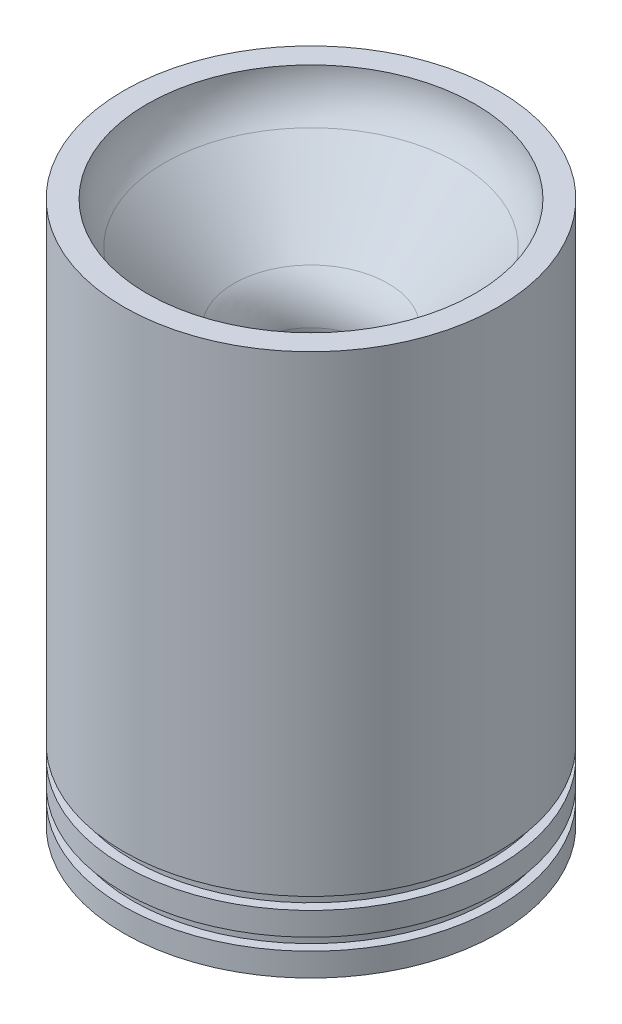
ISO-10303-21;
HEADER;
FILE_DESCRIPTION(('STEP AP214'),'2;1');
FILE_NAME('part.step','',(''),(''),'','','');
FILE_SCHEMA(('AUTOMOTIVE_DESIGN { 1 0 10303 214 1 1 1 1 }'));
ENDSEC;
DATA;
#1=APPLICATION_CONTEXT('core data for automotive mechanical design processes');
#2=APPLICATION_PROTOCOL_DEFINITION('international standard','automotive_design',2000,#1);
#3=PRODUCT_CONTEXT('',#1,'mechanical');
#4=PRODUCT('Part','Part','',(#3));
#5=PRODUCT_RELATED_PRODUCT_CATEGORY('part','',(#4));
#6=PRODUCT_DEFINITION_FORMATION('','',#4);
#7=PRODUCT_DEFINITION_CONTEXT('part definition',#1,'design');
#8=PRODUCT_DEFINITION('design','',#6,#7);
#9=PRODUCT_DEFINITION_SHAPE('','',#8);
#10=(LENGTH_UNIT() NAMED_UNIT(*) SI_UNIT(.MILLI.,.METRE.));
#11=(NAMED_UNIT(*) PLANE_ANGLE_UNIT() SI_UNIT($,.RADIAN.));
#12=(NAMED_UNIT(*) SI_UNIT($,.STERADIAN.) SOLID_ANGLE_UNIT());
#13=UNCERTAINTY_MEASURE_WITH_UNIT(LENGTH_MEASURE(1.E-05),#10,'distance_accuracy_value','');
#14=(GEOMETRIC_REPRESENTATION_CONTEXT(3) GLOBAL_UNCERTAINTY_ASSIGNED_CONTEXT((#13)) GLOBAL_UNIT_ASSIGNED_CONTEXT((#10,
#11,#12)) REPRESENTATION_CONTEXT('',''));
#15=CARTESIAN_POINT('',(0.,0.,0.));
#16=DIRECTION('',(0.,0.,1.));
#17=DIRECTION('',(1.,0.,0.));
#18=AXIS2_PLACEMENT_3D('',#15,#16,#17);
#19=CARTESIAN_POINT('',(-44.7802,0.,0.));
#20=DIRECTION('',(0.,1.,0.));
#21=DIRECTION('',(0.,0.,1.));
#22=AXIS2_PLACEMENT_3D('',#19,#20,#21);
#23=PLANE('',#22);
#24=CARTESIAN_POINT('',(0.,0.,0.));
#25=DIRECTION('',(0.,1.,0.));
#26=DIRECTION('',(0.,0.,1.));
#27=AXIS2_PLACEMENT_3D('',#24,#25,#26);
#28=CIRCLE('',#27,51.1302);
#29=CARTESIAN_POINT('',(0.,0.,51.1302));
#30=VERTEX_POINT('',#29);
#31=EDGE_CURVE('E133',#30,#30,#28,.T.);
#32=ORIENTED_EDGE('',*,*,#31,.T.);
#33=EDGE_LOOP('',(#32));
#34=FACE_BOUND('',#33,.T.);
#35=CARTESIAN_POINT('',(0.,0.,0.));
#36=DIRECTION('',(0.,1.,0.));
#37=DIRECTION('',(0.,0.,1.));
#38=AXIS2_PLACEMENT_3D('',#35,#36,#37);
#39=CIRCLE('',#38,44.7802);
#40=CARTESIAN_POINT('',(0.,0.,44.7802));
#41=VERTEX_POINT('',#40);
#42=EDGE_CURVE('E11',#41,#41,#39,.T.);
#43=ORIENTED_EDGE('',*,*,#42,.F.);
#44=EDGE_LOOP('',(#43));
#45=FACE_BOUND('',#44,.T.);
#46=ADVANCED_FACE('F42',(#34,#45),#23,.T.);
#47=CARTESIAN_POINT('',(0.,0.,0.));
#48=DIRECTION('',(0.,1.,0.));
#49=DIRECTION('',(0.,0.,1.));
#50=AXIS2_PLACEMENT_3D('',#47,#48,#49);
#51=TOROIDAL_SURFACE('',#50,28.5242,16.256);
#52=ORIENTED_EDGE('',*,*,#42,.T.);
#53=EDGE_LOOP('',(#52));
#54=FACE_BOUND('',#53,.T.);
#55=CARTESIAN_POINT('',(0.,-11.4947278349686,0.));
#56=DIRECTION('',(0.,1.,0.));
#57=DIRECTION('',(0.,0.,1.));
#58=AXIS2_PLACEMENT_3D('',#55,#56,#57);
#59=CIRCLE('',#58,40.0189278349684);
#60=CARTESIAN_POINT('',(0.,-11.4947278349686,40.0189278349684));
#61=VERTEX_POINT('',#60);
#62=EDGE_CURVE('E50',#61,#61,#59,.T.);
#63=ORIENTED_EDGE('',*,*,#62,.F.);
#64=EDGE_LOOP('',(#63));
#65=FACE_BOUND('',#64,.T.);
#66=ADVANCED_FACE('F153',(#54,#65),#51,.F.);
#67=CARTESIAN_POINT('',(0.,-30.4963835049053,0.));
#68=DIRECTION('',(0.,1.,0.));
#69=DIRECTION('',(0.,0.,1.));
#70=AXIS2_PLACEMENT_3D('',#67,#68,#69);
#71=CONICAL_SURFACE('',#70,21.0172721650315,0.785398163397454);
#72=ORIENTED_EDGE('',*,*,#62,.T.);
#73=EDGE_LOOP('',(#72));
#74=FACE_BOUND('',#73,.T.);
#75=CARTESIAN_POINT('',(0.,-30.4963835049053,0.));
#76=DIRECTION('',(0.,1.,0.));
#77=DIRECTION('',(0.,0.,1.));
#78=AXIS2_PLACEMENT_3D('',#75,#76,#77);
#79=CIRCLE('',#78,21.0172721650315);
#80=CARTESIAN_POINT('',(0.,-30.4963835049053,21.0172721650315));
#81=VERTEX_POINT('',#80);
#82=EDGE_CURVE('E55',#81,#81,#79,.T.);
#83=ORIENTED_EDGE('',*,*,#82,.F.);
#84=EDGE_LOOP('',(#83));
#85=FACE_BOUND('',#84,.T.);
#86=ADVANCED_FACE('F157',(#74,#85),#71,.F.);
#87=CARTESIAN_POINT('',(0.,-41.9911113398738,0.));
#88=DIRECTION('',(0.,1.,0.));
#89=DIRECTION('',(0.,0.,1.));
#90=AXIS2_PLACEMENT_3D('',#87,#88,#89);
#91=TOROIDAL_SURFACE('',#90,32.512,16.256);
#92=ORIENTED_EDGE('',*,*,#82,.T.);
#93=EDGE_LOOP('',(#92));
#94=FACE_BOUND('',#93,.T.);
#95=CARTESIAN_POINT('',(0.,-41.9911113398738,0.));
#96=DIRECTION('',(0.,1.,0.));
#97=DIRECTION('',(0.,0.,1.));
#98=AXIS2_PLACEMENT_3D('',#95,#96,#97);
#99=CIRCLE('',#98,16.256);
#100=CARTESIAN_POINT('',(0.,-41.9911113398738,16.256));
#101=VERTEX_POINT('',#100);
#102=EDGE_CURVE('E60',#101,#101,#99,.T.);
#103=ORIENTED_EDGE('',*,*,#102,.F.);
#104=EDGE_LOOP('',(#103));
#105=FACE_BOUND('',#104,.T.);
#106=ADVANCED_FACE('F161',(#94,#105),#91,.T.);
#107=CARTESIAN_POINT('',(0.,-41.9911113398738,0.));
#108=DIRECTION('',(0.,1.,0.));
#109=DIRECTION('',(0.,0.,1.));
#110=AXIS2_PLACEMENT_3D('',#107,#108,#109);
#111=TOROIDAL_SURFACE('',#110,22.7584,6.5024);
#112=ORIENTED_EDGE('',*,*,#102,.T.);
#113=EDGE_LOOP('',(#112));
#114=FACE_BOUND('',#113,.T.);
#115=CARTESIAN_POINT('',(0.,-43.6740562987485,0.));
#116=DIRECTION('',(0.,1.,0.));
#117=DIRECTION('',(0.,0.,1.));
#118=AXIS2_PLACEMENT_3D('',#115,#116,#117);
#119=CIRCLE('',#118,16.477563907138);
#120=CARTESIAN_POINT('',(0.,-43.6740562987485,16.477563907138));
#121=VERTEX_POINT('',#120);
#122=EDGE_CURVE('E76',#121,#121,#119,.T.);
#123=ORIENTED_EDGE('',*,*,#122,.F.);
#124=EDGE_LOOP('',(#123));
#125=FACE_BOUND('',#124,.T.);
#126=ADVANCED_FACE('F167',(#114,#125),#111,.T.);
#127=CARTESIAN_POINT('',(0.,-148.068609008784,0.));
#128=DIRECTION('',(0.,-1.,0.));
#129=DIRECTION('',(0.,0.,-1.));
#130=AXIS2_PLACEMENT_3D('',#127,#128,#129);
#131=CONICAL_SURFACE('',#130,44.45,0.261799387799146);
#132=ORIENTED_EDGE('',*,*,#122,.T.);
#133=EDGE_LOOP('',(#132));
#134=FACE_BOUND('',#133,.T.);
#135=CARTESIAN_POINT('',(0.,-148.068609008784,0.));
#136=DIRECTION('',(0.,1.,0.));
#137=DIRECTION('',(0.,0.,1.));
#138=AXIS2_PLACEMENT_3D('',#135,#136,#137);
#139=CIRCLE('',#138,44.45);
#140=CARTESIAN_POINT('',(0.,-148.068609008784,44.45));
#141=VERTEX_POINT('',#140);
#142=EDGE_CURVE('E81',#141,#141,#139,.T.);
#143=ORIENTED_EDGE('',*,*,#142,.F.);
#144=EDGE_LOOP('',(#143));
#145=FACE_BOUND('',#144,.T.);
#146=ADVANCED_FACE('F171',(#134,#145),#131,.F.);
#147=CARTESIAN_POINT('',(-51.1302,-148.068609008784,0.));
#148=DIRECTION('',(0.,-1.,0.));
#149=DIRECTION('',(0.,0.,-1.));
#150=AXIS2_PLACEMENT_3D('',#147,#148,#149);
#151=PLANE('',#150);
#152=ORIENTED_EDGE('',*,*,#142,.T.);
#153=EDGE_LOOP('',(#152));
#154=FACE_BOUND('',#153,.T.);
#155=CARTESIAN_POINT('',(0.,-148.068609008784,0.));
#156=DIRECTION('',(0.,1.,0.));
#157=DIRECTION('',(0.,0.,1.));
#158=AXIS2_PLACEMENT_3D('',#155,#156,#157);
#159=CIRCLE('',#158,51.1302);
#160=CARTESIAN_POINT('',(0.,-148.068609008784,51.1302));
#161=VERTEX_POINT('',#160);
#162=EDGE_CURVE('E86',#161,#161,#159,.T.);
#163=ORIENTED_EDGE('',*,*,#162,.F.);
#164=EDGE_LOOP('',(#163));
#165=FACE_BOUND('',#164,.T.);
#166=ADVANCED_FACE('F175',(#154,#165),#151,.T.);
#167=CARTESIAN_POINT('',(0.,0.,0.));
#168=DIRECTION('',(0.,1.,0.));
#169=DIRECTION('',(0.,0.,1.));
#170=AXIS2_PLACEMENT_3D('',#167,#168,#169);
#171=CYLINDRICAL_SURFACE('',#170,51.1302);
#172=ORIENTED_EDGE('',*,*,#162,.T.);
#173=EDGE_LOOP('',(#172));
#174=FACE_BOUND('',#173,.T.);
#175=CARTESIAN_POINT('',(0.,-141.718609008784,0.));
#176=DIRECTION('',(0.,1.,0.));
#177=DIRECTION('',(0.,0.,1.));
#178=AXIS2_PLACEMENT_3D('',#175,#176,#177);
#179=CIRCLE('',#178,51.1302);
#180=CARTESIAN_POINT('',(0.,-141.718609008784,51.1302));
#181=VERTEX_POINT('',#180);
#182=EDGE_CURVE('E94',#181,#181,#179,.T.);
#183=ORIENTED_EDGE('',*,*,#182,.F.);
#184=EDGE_LOOP('',(#183));
#185=FACE_BOUND('',#184,.T.);
#186=ADVANCED_FACE('F179',(#174,#185),#171,.T.);
#187=CARTESIAN_POINT('',(-51.1302,-141.718609008784,0.));
#188=DIRECTION('',(0.,1.,0.));
#189=DIRECTION('',(0.,0.,1.));
#190=AXIS2_PLACEMENT_3D('',#187,#188,#189);
#191=PLANE('',#190);
#192=ORIENTED_EDGE('',*,*,#182,.T.);
#193=EDGE_LOOP('',(#192));
#194=FACE_BOUND('',#193,.T.);
#195=CARTESIAN_POINT('',(0.,-141.718609008784,0.));
#196=DIRECTION('',(0.,1.,0.));
#197=DIRECTION('',(0.,0.,1.));
#198=AXIS2_PLACEMENT_3D('',#195,#196,#197);
#199=CIRCLE('',#198,48.5902);
#200=CARTESIAN_POINT('',(0.,-141.718609008784,48.5902));
#201=VERTEX_POINT('',#200);
#202=EDGE_CURVE('E98',#201,#201,#199,.T.);
#203=ORIENTED_EDGE('',*,*,#202,.F.);
#204=EDGE_LOOP('',(#203));
#205=FACE_BOUND('',#204,.T.);
#206=ADVANCED_FACE('F183',(#194,#205),#191,.T.);
#207=CARTESIAN_POINT('',(0.,0.,0.));
#208=DIRECTION('',(0.,1.,0.));
#209=DIRECTION('',(0.,0.,1.));
#210=AXIS2_PLACEMENT_3D('',#207,#208,#209);
#211=CYLINDRICAL_SURFACE('',#210,48.5902);
#212=ORIENTED_EDGE('',*,*,#202,.T.);
#213=EDGE_LOOP('',(#212));
#214=FACE_BOUND('',#213,.T.);
#215=CARTESIAN_POINT('',(0.,-138.416609008784,0.));
#216=DIRECTION('',(0.,1.,0.));
#217=DIRECTION('',(0.,0.,1.));
#218=AXIS2_PLACEMENT_3D('',#215,#216,#217);
#219=CIRCLE('',#218,48.5902);
#220=CARTESIAN_POINT('',(0.,-138.416609008784,48.5902));
#221=VERTEX_POINT('',#220);
#222=EDGE_CURVE('E103',#221,#221,#219,.T.);
#223=ORIENTED_EDGE('',*,*,#222,.F.);
#224=EDGE_LOOP('',(#223));
#225=FACE_BOUND('',#224,.T.);
#226=ADVANCED_FACE('F187',(#214,#225),#211,.T.);
#227=CARTESIAN_POINT('',(-48.5902,-138.416609008784,0.));
#228=DIRECTION('',(0.,-1.,0.));
#229=DIRECTION('',(0.,0.,-1.));
#230=AXIS2_PLACEMENT_3D('',#227,#228,#229);
#231=PLANE('',#230);
#232=ORIENTED_EDGE('',*,*,#222,.T.);
#233=EDGE_LOOP('',(#232));
#234=FACE_BOUND('',#233,.T.);
#235=CARTESIAN_POINT('',(0.,-138.416609008784,0.));
#236=DIRECTION('',(0.,1.,0.));
#237=DIRECTION('',(0.,0.,1.));
#238=AXIS2_PLACEMENT_3D('',#235,#236,#237);
#239=CIRCLE('',#238,51.1302);
#240=CARTESIAN_POINT('',(0.,-138.416609008784,51.1302));
#241=VERTEX_POINT('',#240);
#242=EDGE_CURVE('E108',#241,#241,#239,.T.);
#243=ORIENTED_EDGE('',*,*,#242,.F.);
#244=EDGE_LOOP('',(#243));
#245=FACE_BOUND('',#244,.T.);
#246=ADVANCED_FACE('F191',(#234,#245),#231,.T.);
#247=CARTESIAN_POINT('',(0.,0.,0.));
#248=DIRECTION('',(0.,1.,0.));
#249=DIRECTION('',(0.,0.,1.));
#250=AXIS2_PLACEMENT_3D('',#247,#248,#249);
#251=CYLINDRICAL_SURFACE('',#250,51.1302);
#252=ORIENTED_EDGE('',*,*,#242,.T.);
#253=EDGE_LOOP('',(#252));
#254=FACE_BOUND('',#253,.T.);
#255=CARTESIAN_POINT('',(0.,-132.066609008784,0.));
#256=DIRECTION('',(0.,1.,0.));
#257=DIRECTION('',(0.,0.,1.));
#258=AXIS2_PLACEMENT_3D('',#255,#256,#257);
#259=CIRCLE('',#258,51.1302);
#260=CARTESIAN_POINT('',(0.,-132.066609008784,51.1302));
#261=VERTEX_POINT('',#260);
#262=EDGE_CURVE('E115',#261,#261,#259,.T.);
#263=ORIENTED_EDGE('',*,*,#262,.F.);
#264=EDGE_LOOP('',(#263));
#265=FACE_BOUND('',#264,.T.);
#266=ADVANCED_FACE('F195',(#254,#265),#251,.T.);
#267=CARTESIAN_POINT('',(-51.1302,-132.066609008784,0.));
#268=DIRECTION('',(0.,1.,0.));
#269=DIRECTION('',(0.,0.,1.));
#270=AXIS2_PLACEMENT_3D('',#267,#268,#269);
#271=PLANE('',#270);
#272=ORIENTED_EDGE('',*,*,#262,.T.);
#273=EDGE_LOOP('',(#272));
#274=FACE_BOUND('',#273,.T.);
#275=CARTESIAN_POINT('',(0.,-132.066609008784,0.));
#276=DIRECTION('',(0.,1.,0.));
#277=DIRECTION('',(0.,0.,1.));
#278=AXIS2_PLACEMENT_3D('',#275,#276,#277);
#279=CIRCLE('',#278,48.5902);
#280=CARTESIAN_POINT('',(0.,-132.066609008784,48.5902));
#281=VERTEX_POINT('',#280);
#282=EDGE_CURVE('E119',#281,#281,#279,.T.);
#283=ORIENTED_EDGE('',*,*,#282,.F.);
#284=EDGE_LOOP('',(#283));
#285=FACE_BOUND('',#284,.T.);
#286=ADVANCED_FACE('F199',(#274,#285),#271,.T.);
#287=CARTESIAN_POINT('',(0.,0.,0.));
#288=DIRECTION('',(0.,1.,0.));
#289=DIRECTION('',(0.,0.,1.));
#290=AXIS2_PLACEMENT_3D('',#287,#288,#289);
#291=CYLINDRICAL_SURFACE('',#290,48.5902);
#292=ORIENTED_EDGE('',*,*,#282,.T.);
#293=EDGE_LOOP('',(#292));
#294=FACE_BOUND('',#293,.T.);
#295=CARTESIAN_POINT('',(0.,-128.764609008784,0.));
#296=DIRECTION('',(0.,1.,0.));
#297=DIRECTION('',(0.,0.,1.));
#298=AXIS2_PLACEMENT_3D('',#295,#296,#297);
#299=CIRCLE('',#298,48.5902);
#300=CARTESIAN_POINT('',(0.,-128.764609008784,48.5902));
#301=VERTEX_POINT('',#300);
#302=EDGE_CURVE('E124',#301,#301,#299,.T.);
#303=ORIENTED_EDGE('',*,*,#302,.F.);
#304=EDGE_LOOP('',(#303));
#305=FACE_BOUND('',#304,.T.);
#306=ADVANCED_FACE('F149',(#294,#305),#291,.T.);
#307=CARTESIAN_POINT('',(-48.5902,-128.764609008784,0.));
#308=DIRECTION('',(0.,-1.,0.));
#309=DIRECTION('',(0.,0.,-1.));
#310=AXIS2_PLACEMENT_3D('',#307,#308,#309);
#311=PLANE('',#310);
#312=ORIENTED_EDGE('',*,*,#302,.T.);
#313=EDGE_LOOP('',(#312));
#314=FACE_BOUND('',#313,.T.);
#315=CARTESIAN_POINT('',(0.,-128.764609008784,0.));
#316=DIRECTION('',(0.,1.,0.));
#317=DIRECTION('',(0.,0.,1.));
#318=AXIS2_PLACEMENT_3D('',#315,#316,#317);
#319=CIRCLE('',#318,51.1302);
#320=CARTESIAN_POINT('',(0.,-128.764609008784,51.1302));
#321=VERTEX_POINT('',#320);
#322=EDGE_CURVE('E128',#321,#321,#319,.T.);
#323=ORIENTED_EDGE('',*,*,#322,.F.);
#324=EDGE_LOOP('',(#323));
#325=FACE_BOUND('',#324,.T.);
#326=ADVANCED_FACE('F143',(#314,#325),#311,.T.);
#327=CARTESIAN_POINT('',(0.,0.,0.));
#328=DIRECTION('',(0.,1.,0.));
#329=DIRECTION('',(0.,0.,1.));
#330=AXIS2_PLACEMENT_3D('',#327,#328,#329);
#331=CYLINDRICAL_SURFACE('',#330,51.1302);
#332=ORIENTED_EDGE('',*,*,#322,.T.);
#333=EDGE_LOOP('',(#332));
#334=FACE_BOUND('',#333,.T.);
#335=ORIENTED_EDGE('',*,*,#31,.F.);
#336=EDGE_LOOP('',(#335));
#337=FACE_BOUND('',#336,.T.);
#338=ADVANCED_FACE('F141',(#334,#337),#331,.T.);
#339=CLOSED_SHELL('',(#46,#66,#86,#106,#126,#146,#166,#186,#206,#226,#246,#266,#286,#306,#326,#338));
#340=MANIFOLD_SOLID_BREP('B2',#339);
#341=ADVANCED_BREP_SHAPE_REPRESENTATION('',(#18,#340),#14);
#342=SHAPE_DEFINITION_REPRESENTATION(#9,#341);
ENDSEC;
END-ISO-10303-21;
